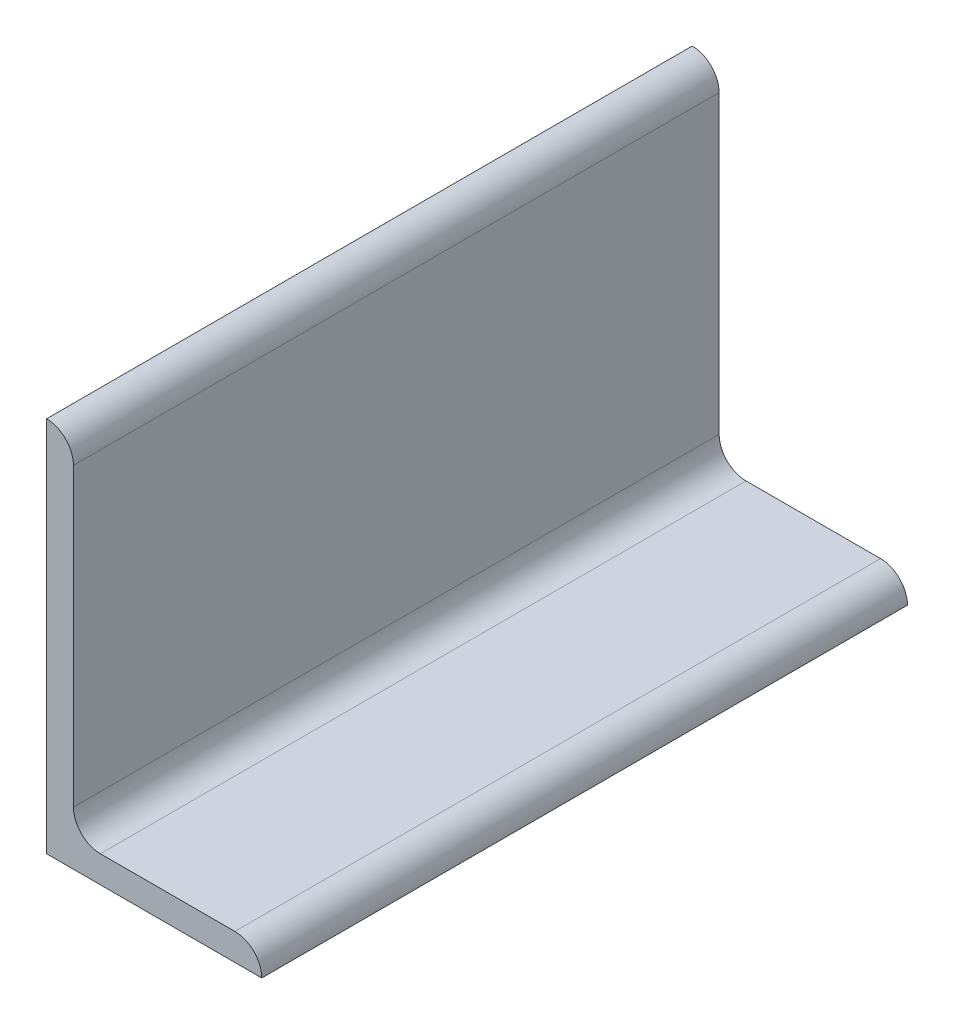
ISO-10303-21;
HEADER;
FILE_DESCRIPTION(('STEP AP214'),'2;1');
FILE_NAME('part.step','',(''),(''),'','','');
FILE_SCHEMA(('AUTOMOTIVE_DESIGN { 1 0 10303 214 1 1 1 1 }'));
ENDSEC;
DATA;
#1=APPLICATION_CONTEXT('core data for automotive mechanical design processes');
#2=APPLICATION_PROTOCOL_DEFINITION('international standard','automotive_design',2000,#1);
#3=PRODUCT_CONTEXT('',#1,'mechanical');
#4=PRODUCT('Part','Part','',(#3));
#5=PRODUCT_RELATED_PRODUCT_CATEGORY('part','',(#4));
#6=PRODUCT_DEFINITION_FORMATION('','',#4);
#7=PRODUCT_DEFINITION_CONTEXT('part definition',#1,'design');
#8=PRODUCT_DEFINITION('design','',#6,#7);
#9=PRODUCT_DEFINITION_SHAPE('','',#8);
#10=(LENGTH_UNIT() NAMED_UNIT(*) SI_UNIT(.MILLI.,.METRE.));
#11=(NAMED_UNIT(*) PLANE_ANGLE_UNIT() SI_UNIT($,.RADIAN.));
#12=(NAMED_UNIT(*) SI_UNIT($,.STERADIAN.) SOLID_ANGLE_UNIT());
#13=UNCERTAINTY_MEASURE_WITH_UNIT(LENGTH_MEASURE(1.E-05),#10,'distance_accuracy_value','');
#14=(GEOMETRIC_REPRESENTATION_CONTEXT(3) GLOBAL_UNCERTAINTY_ASSIGNED_CONTEXT((#13)) GLOBAL_UNIT_ASSIGNED_CONTEXT((#10,
#11,#12)) REPRESENTATION_CONTEXT('',''));
#15=CARTESIAN_POINT('',(0.,0.,0.));
#16=DIRECTION('',(0.,0.,1.));
#17=DIRECTION('',(1.,0.,0.));
#18=AXIS2_PLACEMENT_3D('',#15,#16,#17);
#19=CARTESIAN_POINT('',(101.6,0.,152.4));
#20=DIRECTION('',(0.,1.,0.));
#21=DIRECTION('',(-1.,0.,0.));
#22=AXIS2_PLACEMENT_3D('',#19,#20,#21);
#23=PLANE('',#22);
#24=DIRECTION('',(1.,0.,0.));
#25=VECTOR('',#24,1.);
#26=CARTESIAN_POINT('',(101.6,0.,-152.4));
#27=LINE('',#26,#25);
#28=CARTESIAN_POINT('',(0.,0.,-152.4));
#29=VERTEX_POINT('',#28);
#30=CARTESIAN_POINT('',(101.6,0.,-152.4));
#31=VERTEX_POINT('',#30);
#32=EDGE_CURVE('E136',#29,#31,#27,.T.);
#33=ORIENTED_EDGE('',*,*,#32,.T.);
#34=DIRECTION('',(0.,0.,-1.));
#35=VECTOR('',#34,1.);
#36=CARTESIAN_POINT('',(101.6,0.,152.4));
#37=LINE('',#36,#35);
#38=CARTESIAN_POINT('',(101.6,0.,152.4));
#39=VERTEX_POINT('',#38);
#40=EDGE_CURVE('E11',#39,#31,#37,.T.);
#41=ORIENTED_EDGE('',*,*,#40,.F.);
#42=DIRECTION('',(1.,0.,0.));
#43=VECTOR('',#42,1.);
#44=CARTESIAN_POINT('',(101.6,0.,152.4));
#45=LINE('',#44,#43);
#46=CARTESIAN_POINT('',(0.,0.,152.4));
#47=VERTEX_POINT('',#46);
#48=EDGE_CURVE('E152',#47,#39,#45,.T.);
#49=ORIENTED_EDGE('',*,*,#48,.F.);
#50=DIRECTION('',(0.,0.,-1.));
#51=VECTOR('',#50,1.);
#52=CARTESIAN_POINT('',(0.,0.,152.4));
#53=LINE('',#52,#51);
#54=EDGE_CURVE('E132',#47,#29,#53,.T.);
#55=ORIENTED_EDGE('',*,*,#54,.T.);
#56=EDGE_LOOP('',(#33,#41,#49,#55));
#57=FACE_BOUND('',#56,.T.);
#58=ADVANCED_FACE('F34',(#57),#23,.F.);
#59=CARTESIAN_POINT('',(101.6,0.00508000000000622,152.4));
#60=DIRECTION('',(-1.,0.,0.));
#61=DIRECTION('',(0.,0.,1.));
#62=AXIS2_PLACEMENT_3D('',#59,#60,#61);
#63=PLANE('',#62);
#64=DIRECTION('',(0.,1.,0.));
#65=VECTOR('',#64,1.);
#66=CARTESIAN_POINT('',(101.6,0.00508000000000622,-152.4));
#67=LINE('',#66,#65);
#68=CARTESIAN_POINT('',(101.6,0.00508000000000622,-152.4));
#69=VERTEX_POINT('',#68);
#70=EDGE_CURVE('E139',#31,#69,#67,.T.);
#71=ORIENTED_EDGE('',*,*,#70,.T.);
#72=DIRECTION('',(0.,0.,-1.));
#73=VECTOR('',#72,1.);
#74=CARTESIAN_POINT('',(101.6,0.00508000000000622,152.4));
#75=LINE('',#74,#73);
#76=CARTESIAN_POINT('',(101.6,0.00508000000000622,152.4));
#77=VERTEX_POINT('',#76);
#78=EDGE_CURVE('E42',#77,#69,#75,.T.);
#79=ORIENTED_EDGE('',*,*,#78,.F.);
#80=DIRECTION('',(0.,1.,0.));
#81=VECTOR('',#80,1.);
#82=CARTESIAN_POINT('',(101.6,0.00508000000000622,152.4));
#83=LINE('',#82,#81);
#84=EDGE_CURVE('E96',#39,#77,#83,.T.);
#85=ORIENTED_EDGE('',*,*,#84,.F.);
#86=ORIENTED_EDGE('',*,*,#40,.T.);
#87=EDGE_LOOP('',(#71,#79,#85,#86));
#88=FACE_BOUND('',#87,.T.);
#89=ADVANCED_FACE('F195',(#88),#63,.F.);
#90=CARTESIAN_POINT('',(88.90508,0.00508000000000467,152.4));
#91=DIRECTION('',(0.,0.,-1.));
#92=DIRECTION('',(-1.,0.,0.));
#93=AXIS2_PLACEMENT_3D('',#90,#91,#92);
#94=CYLINDRICAL_SURFACE('',#93,12.69492);
#95=CARTESIAN_POINT('',(88.90508,0.00508000000000467,-152.4));
#96=DIRECTION('',(0.,0.,1.));
#97=DIRECTION('',(1.,0.,0.));
#98=AXIS2_PLACEMENT_3D('',#95,#96,#97);
#99=CIRCLE('',#98,12.69492);
#100=CARTESIAN_POINT('',(88.90508,12.7,-152.4));
#101=VERTEX_POINT('',#100);
#102=EDGE_CURVE('E141',#69,#101,#99,.T.);
#103=ORIENTED_EDGE('',*,*,#102,.T.);
#104=DIRECTION('',(0.,0.,-1.));
#105=VECTOR('',#104,1.);
#106=CARTESIAN_POINT('',(88.90508,12.7,152.4));
#107=LINE('',#106,#105);
#108=CARTESIAN_POINT('',(88.90508,12.7,152.4));
#109=VERTEX_POINT('',#108);
#110=EDGE_CURVE('E162',#109,#101,#107,.T.);
#111=ORIENTED_EDGE('',*,*,#110,.F.);
#112=CARTESIAN_POINT('',(88.90508,0.00508000000000467,152.4));
#113=DIRECTION('',(0.,0.,1.));
#114=DIRECTION('',(1.,0.,0.));
#115=AXIS2_PLACEMENT_3D('',#112,#113,#114);
#116=CIRCLE('',#115,12.69492);
#117=EDGE_CURVE('E170',#77,#109,#116,.T.);
#118=ORIENTED_EDGE('',*,*,#117,.F.);
#119=ORIENTED_EDGE('',*,*,#78,.T.);
#120=EDGE_LOOP('',(#103,#111,#118,#119));
#121=FACE_BOUND('',#120,.T.);
#122=ADVANCED_FACE('F168',(#121),#94,.T.);
#123=CARTESIAN_POINT('',(25.4,12.7,152.4));
#124=DIRECTION('',(0.,-1.,0.));
#125=DIRECTION('',(1.,0.,0.));
#126=AXIS2_PLACEMENT_3D('',#123,#124,#125);
#127=PLANE('',#126);
#128=DIRECTION('',(-1.,0.,0.));
#129=VECTOR('',#128,1.);
#130=CARTESIAN_POINT('',(25.4,12.7,-152.4));
#131=LINE('',#130,#129);
#132=CARTESIAN_POINT('',(25.4,12.7,-152.4));
#133=VERTEX_POINT('',#132);
#134=EDGE_CURVE('E143',#101,#133,#131,.T.);
#135=ORIENTED_EDGE('',*,*,#134,.T.);
#136=DIRECTION('',(0.,0.,-1.));
#137=VECTOR('',#136,1.);
#138=CARTESIAN_POINT('',(25.4,12.7,152.4));
#139=LINE('',#138,#137);
#140=CARTESIAN_POINT('',(25.4,12.7,152.4));
#141=VERTEX_POINT('',#140);
#142=EDGE_CURVE('E159',#141,#133,#139,.T.);
#143=ORIENTED_EDGE('',*,*,#142,.F.);
#144=DIRECTION('',(-1.,0.,0.));
#145=VECTOR('',#144,1.);
#146=CARTESIAN_POINT('',(25.4,12.7,152.4));
#147=LINE('',#146,#145);
#148=EDGE_CURVE('E186',#109,#141,#147,.T.);
#149=ORIENTED_EDGE('',*,*,#148,.F.);
#150=ORIENTED_EDGE('',*,*,#110,.T.);
#151=EDGE_LOOP('',(#135,#143,#149,#150));
#152=FACE_BOUND('',#151,.T.);
#153=ADVANCED_FACE('F179',(#152),#127,.F.);
#154=CARTESIAN_POINT('',(25.4,25.4,152.4));
#155=DIRECTION('',(0.,0.,-1.));
#156=DIRECTION('',(-1.,0.,0.));
#157=AXIS2_PLACEMENT_3D('',#154,#155,#156);
#158=CYLINDRICAL_SURFACE('',#157,12.7);
#159=CARTESIAN_POINT('',(25.4,25.4,-152.4));
#160=DIRECTION('',(0.,0.,-1.));
#161=DIRECTION('',(-1.,0.,0.));
#162=AXIS2_PLACEMENT_3D('',#159,#160,#161);
#163=CIRCLE('',#162,12.7);
#164=CARTESIAN_POINT('',(12.7,25.4,-152.4));
#165=VERTEX_POINT('',#164);
#166=EDGE_CURVE('E145',#133,#165,#163,.T.);
#167=ORIENTED_EDGE('',*,*,#166,.T.);
#168=DIRECTION('',(0.,0.,-1.));
#169=VECTOR('',#168,1.);
#170=CARTESIAN_POINT('',(12.7,25.4,152.4));
#171=LINE('',#170,#169);
#172=CARTESIAN_POINT('',(12.7,25.4,152.4));
#173=VERTEX_POINT('',#172);
#174=EDGE_CURVE('E156',#173,#165,#171,.T.);
#175=ORIENTED_EDGE('',*,*,#174,.F.);
#176=CARTESIAN_POINT('',(25.4,25.4,152.4));
#177=DIRECTION('',(0.,0.,-1.));
#178=DIRECTION('',(-1.,0.,0.));
#179=AXIS2_PLACEMENT_3D('',#176,#177,#178);
#180=CIRCLE('',#179,12.7);
#181=EDGE_CURVE('E185',#141,#173,#180,.T.);
#182=ORIENTED_EDGE('',*,*,#181,.F.);
#183=ORIENTED_EDGE('',*,*,#142,.T.);
#184=EDGE_LOOP('',(#167,#175,#182,#183));
#185=FACE_BOUND('',#184,.T.);
#186=ADVANCED_FACE('F183',(#185),#158,.F.);
#187=CARTESIAN_POINT('',(12.7,165.10508,152.4));
#188=DIRECTION('',(-1.,0.,0.));
#189=DIRECTION('',(0.,-1.,0.));
#190=AXIS2_PLACEMENT_3D('',#187,#188,#189);
#191=PLANE('',#190);
#192=DIRECTION('',(0.,1.,0.));
#193=VECTOR('',#192,1.);
#194=CARTESIAN_POINT('',(12.7,165.10508,-152.4));
#195=LINE('',#194,#193);
#196=CARTESIAN_POINT('',(12.7,165.10508,-152.4));
#197=VERTEX_POINT('',#196);
#198=EDGE_CURVE('E147',#165,#197,#195,.T.);
#199=ORIENTED_EDGE('',*,*,#198,.T.);
#200=DIRECTION('',(0.,0.,-1.));
#201=VECTOR('',#200,1.);
#202=CARTESIAN_POINT('',(12.7,165.10508,152.4));
#203=LINE('',#202,#201);
#204=CARTESIAN_POINT('',(12.7,165.10508,152.4));
#205=VERTEX_POINT('',#204);
#206=EDGE_CURVE('E127',#205,#197,#203,.T.);
#207=ORIENTED_EDGE('',*,*,#206,.F.);
#208=DIRECTION('',(0.,1.,0.));
#209=VECTOR('',#208,1.);
#210=CARTESIAN_POINT('',(12.7,165.10508,152.4));
#211=LINE('',#210,#209);
#212=EDGE_CURVE('E118',#173,#205,#211,.T.);
#213=ORIENTED_EDGE('',*,*,#212,.F.);
#214=ORIENTED_EDGE('',*,*,#174,.T.);
#215=EDGE_LOOP('',(#199,#207,#213,#214));
#216=FACE_BOUND('',#215,.T.);
#217=ADVANCED_FACE('F207',(#216),#191,.F.);
#218=CARTESIAN_POINT('',(0.00508000000000078,165.10508,152.4));
#219=DIRECTION('',(0.,0.,-1.));
#220=DIRECTION('',(-1.,0.,0.));
#221=AXIS2_PLACEMENT_3D('',#218,#219,#220);
#222=CYLINDRICAL_SURFACE('',#221,12.69492);
#223=CARTESIAN_POINT('',(0.00508000000000078,165.10508,-152.4));
#224=DIRECTION('',(0.,0.,1.));
#225=DIRECTION('',(-1.,0.,0.));
#226=AXIS2_PLACEMENT_3D('',#223,#224,#225);
#227=CIRCLE('',#226,12.69492);
#228=CARTESIAN_POINT('',(0.00508,177.8,-152.4));
#229=VERTEX_POINT('',#228);
#230=EDGE_CURVE('E126',#197,#229,#227,.T.);
#231=ORIENTED_EDGE('',*,*,#230,.T.);
#232=DIRECTION('',(0.,0.,-1.));
#233=VECTOR('',#232,1.);
#234=CARTESIAN_POINT('',(0.00508,177.8,152.4));
#235=LINE('',#234,#233);
#236=CARTESIAN_POINT('',(0.00508,177.8,152.4));
#237=VERTEX_POINT('',#236);
#238=EDGE_CURVE('E123',#237,#229,#235,.T.);
#239=ORIENTED_EDGE('',*,*,#238,.F.);
#240=CARTESIAN_POINT('',(0.00508000000000078,165.10508,152.4));
#241=DIRECTION('',(0.,0.,1.));
#242=DIRECTION('',(-1.,0.,0.));
#243=AXIS2_PLACEMENT_3D('',#240,#241,#242);
#244=CIRCLE('',#243,12.69492);
#245=EDGE_CURVE('E112',#205,#237,#244,.T.);
#246=ORIENTED_EDGE('',*,*,#245,.F.);
#247=ORIENTED_EDGE('',*,*,#206,.T.);
#248=EDGE_LOOP('',(#231,#239,#246,#247));
#249=FACE_BOUND('',#248,.T.);
#250=ADVANCED_FACE('F124',(#249),#222,.T.);
#251=CARTESIAN_POINT('',(0.,177.8,152.4));
#252=DIRECTION('',(0.,-1.,0.));
#253=DIRECTION('',(0.,0.,-1.));
#254=AXIS2_PLACEMENT_3D('',#251,#252,#253);
#255=PLANE('',#254);
#256=DIRECTION('',(-1.,0.,0.));
#257=VECTOR('',#256,1.);
#258=CARTESIAN_POINT('',(0.,177.8,-152.4));
#259=LINE('',#258,#257);
#260=CARTESIAN_POINT('',(0.,177.8,-152.4));
#261=VERTEX_POINT('',#260);
#262=EDGE_CURVE('E82',#229,#261,#259,.T.);
#263=ORIENTED_EDGE('',*,*,#262,.T.);
#264=DIRECTION('',(0.,0.,-1.));
#265=VECTOR('',#264,1.);
#266=CARTESIAN_POINT('',(0.,177.8,152.4));
#267=LINE('',#266,#265);
#268=CARTESIAN_POINT('',(0.,177.8,152.4));
#269=VERTEX_POINT('',#268);
#270=EDGE_CURVE('E128',#269,#261,#267,.T.);
#271=ORIENTED_EDGE('',*,*,#270,.F.);
#272=DIRECTION('',(-1.,0.,0.));
#273=VECTOR('',#272,1.);
#274=CARTESIAN_POINT('',(0.,177.8,152.4));
#275=LINE('',#274,#273);
#276=EDGE_CURVE('E116',#237,#269,#275,.T.);
#277=ORIENTED_EDGE('',*,*,#276,.F.);
#278=ORIENTED_EDGE('',*,*,#238,.T.);
#279=EDGE_LOOP('',(#263,#271,#277,#278));
#280=FACE_BOUND('',#279,.T.);
#281=ADVANCED_FACE('F130',(#280),#255,.F.);
#282=CARTESIAN_POINT('',(0.,0.,152.4));
#283=DIRECTION('',(1.,0.,0.));
#284=DIRECTION('',(0.,0.,-1.));
#285=AXIS2_PLACEMENT_3D('',#282,#283,#284);
#286=PLANE('',#285);
#287=DIRECTION('',(0.,-1.,0.));
#288=VECTOR('',#287,1.);
#289=CARTESIAN_POINT('',(0.,0.,-152.4));
#290=LINE('',#289,#288);
#291=EDGE_CURVE('E88',#261,#29,#290,.T.);
#292=ORIENTED_EDGE('',*,*,#291,.T.);
#293=ORIENTED_EDGE('',*,*,#54,.F.);
#294=DIRECTION('',(0.,-1.,0.));
#295=VECTOR('',#294,1.);
#296=CARTESIAN_POINT('',(0.,0.,152.4));
#297=LINE('',#296,#295);
#298=EDGE_CURVE('E50',#269,#47,#297,.T.);
#299=ORIENTED_EDGE('',*,*,#298,.F.);
#300=ORIENTED_EDGE('',*,*,#270,.T.);
#301=EDGE_LOOP('',(#292,#293,#299,#300));
#302=FACE_BOUND('',#301,.T.);
#303=ADVANCED_FACE('F215',(#302),#286,.F.);
#304=CARTESIAN_POINT('',(0.00508000000000078,165.10508,152.4));
#305=DIRECTION('',(0.,0.,-1.));
#306=DIRECTION('',(-1.,0.,0.));
#307=AXIS2_PLACEMENT_3D('',#304,#305,#306);
#308=PLANE('',#307);
#309=ORIENTED_EDGE('',*,*,#48,.T.);
#310=ORIENTED_EDGE('',*,*,#84,.T.);
#311=ORIENTED_EDGE('',*,*,#117,.T.);
#312=ORIENTED_EDGE('',*,*,#148,.T.);
#313=ORIENTED_EDGE('',*,*,#181,.T.);
#314=ORIENTED_EDGE('',*,*,#212,.T.);
#315=ORIENTED_EDGE('',*,*,#245,.T.);
#316=ORIENTED_EDGE('',*,*,#276,.T.);
#317=ORIENTED_EDGE('',*,*,#298,.T.);
#318=EDGE_LOOP('',(#309,#310,#311,#312,#313,#314,#315,#316,#317));
#319=FACE_BOUND('',#318,.T.);
#320=ADVANCED_FACE('F114',(#319),#308,.F.);
#321=CARTESIAN_POINT('',(0.00508000000000078,165.10508,-152.4));
#322=DIRECTION('',(0.,0.,-1.));
#323=DIRECTION('',(-1.,0.,0.));
#324=AXIS2_PLACEMENT_3D('',#321,#322,#323);
#325=PLANE('',#324);
#326=ORIENTED_EDGE('',*,*,#32,.F.);
#327=ORIENTED_EDGE('',*,*,#291,.F.);
#328=ORIENTED_EDGE('',*,*,#262,.F.);
#329=ORIENTED_EDGE('',*,*,#230,.F.);
#330=ORIENTED_EDGE('',*,*,#198,.F.);
#331=ORIENTED_EDGE('',*,*,#166,.F.);
#332=ORIENTED_EDGE('',*,*,#134,.F.);
#333=ORIENTED_EDGE('',*,*,#102,.F.);
#334=ORIENTED_EDGE('',*,*,#70,.F.);
#335=EDGE_LOOP('',(#326,#327,#328,#329,#330,#331,#332,#333,#334));
#336=FACE_BOUND('',#335,.T.);
#337=ADVANCED_FACE('F174',(#336),#325,.T.);
#338=CLOSED_SHELL('',(#58,#89,#122,#153,#186,#217,#250,#281,#303,#320,#337));
#339=MANIFOLD_SOLID_BREP('B2',#338);
#340=ADVANCED_BREP_SHAPE_REPRESENTATION('',(#18,#339),#14);
#341=SHAPE_DEFINITION_REPRESENTATION(#9,#340);
ENDSEC;
END-ISO-10303-21;
